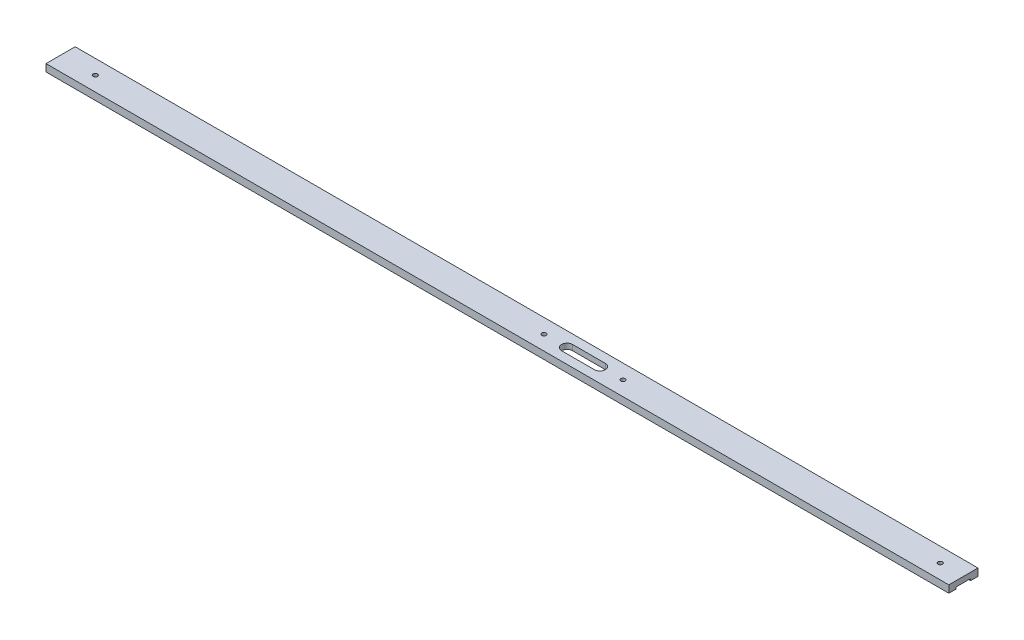
ISO-10303-21;
HEADER;
FILE_DESCRIPTION(('STEP AP214'),'2;1');
FILE_NAME('part.step','',(''),(''),'','','');
FILE_SCHEMA(('AUTOMOTIVE_DESIGN { 1 0 10303 214 1 1 1 1 }'));
ENDSEC;
DATA;
#1=APPLICATION_CONTEXT('core data for automotive mechanical design processes');
#2=APPLICATION_PROTOCOL_DEFINITION('international standard','automotive_design',2000,#1);
#3=PRODUCT_CONTEXT('',#1,'mechanical');
#4=PRODUCT('Part','Part','',(#3));
#5=PRODUCT_RELATED_PRODUCT_CATEGORY('part','',(#4));
#6=PRODUCT_DEFINITION_FORMATION('','',#4);
#7=PRODUCT_DEFINITION_CONTEXT('part definition',#1,'design');
#8=PRODUCT_DEFINITION('design','',#6,#7);
#9=PRODUCT_DEFINITION_SHAPE('','',#8);
#10=(LENGTH_UNIT() NAMED_UNIT(*) SI_UNIT(.MILLI.,.METRE.));
#11=(NAMED_UNIT(*) PLANE_ANGLE_UNIT() SI_UNIT($,.RADIAN.));
#12=(NAMED_UNIT(*) SI_UNIT($,.STERADIAN.) SOLID_ANGLE_UNIT());
#13=UNCERTAINTY_MEASURE_WITH_UNIT(LENGTH_MEASURE(1.E-05),#10,'distance_accuracy_value','');
#14=(GEOMETRIC_REPRESENTATION_CONTEXT(3) GLOBAL_UNCERTAINTY_ASSIGNED_CONTEXT((#13)) GLOBAL_UNIT_ASSIGNED_CONTEXT((#10,
#11,#12)) REPRESENTATION_CONTEXT('',''));
#15=CARTESIAN_POINT('',(0.,0.,0.));
#16=DIRECTION('',(0.,0.,1.));
#17=DIRECTION('',(1.,0.,0.));
#18=AXIS2_PLACEMENT_3D('',#15,#16,#17);
#19=CARTESIAN_POINT('',(123.825,2.,-4.));
#20=DIRECTION('',(0.,-1.,0.));
#21=DIRECTION('',(0.,0.,-1.));
#22=AXIS2_PLACEMENT_3D('',#19,#20,#21);
#23=PLANE('',#22);
#24=CARTESIAN_POINT('',(-114.3,2.,0.));
#25=DIRECTION('',(0.,1.,0.));
#26=DIRECTION('',(0.,0.,1.));
#27=AXIS2_PLACEMENT_3D('',#24,#25,#26);
#28=CIRCLE('',#27,0.595629999999986);
#29=CARTESIAN_POINT('',(-114.3,2.,0.595629999999986));
#30=VERTEX_POINT('',#29);
#31=EDGE_CURVE('E232',#30,#30,#28,.T.);
#32=ORIENTED_EDGE('',*,*,#31,.F.);
#33=EDGE_LOOP('',(#32));
#34=FACE_BOUND('',#33,.T.);
#35=CARTESIAN_POINT('',(8.7588,2.,0.));
#36=DIRECTION('',(0.,1.,0.));
#37=DIRECTION('',(0.,0.,1.));
#38=AXIS2_PLACEMENT_3D('',#35,#36,#37);
#39=CIRCLE('',#38,0.595629999999989);
#40=CARTESIAN_POINT('',(8.7588,2.,0.595629999999989));
#41=VERTEX_POINT('',#40);
#42=EDGE_CURVE('E222',#41,#41,#39,.T.);
#43=ORIENTED_EDGE('',*,*,#42,.F.);
#44=EDGE_LOOP('',(#43));
#45=FACE_BOUND('',#44,.T.);
#46=CARTESIAN_POINT('',(30.4588,2.,0.));
#47=DIRECTION('',(0.,1.,0.));
#48=DIRECTION('',(0.,0.,1.));
#49=AXIS2_PLACEMENT_3D('',#46,#47,#48);
#50=CIRCLE('',#49,0.595629999999989);
#51=CARTESIAN_POINT('',(30.4588,2.,0.595629999999989));
#52=VERTEX_POINT('',#51);
#53=EDGE_CURVE('E219',#52,#52,#50,.T.);
#54=ORIENTED_EDGE('',*,*,#53,.F.);
#55=EDGE_LOOP('',(#54));
#56=FACE_BOUND('',#55,.T.);
#57=CARTESIAN_POINT('',(117.475,2.,0.));
#58=DIRECTION('',(0.,1.,0.));
#59=DIRECTION('',(0.,0.,1.));
#60=AXIS2_PLACEMENT_3D('',#57,#58,#59);
#61=CIRCLE('',#60,0.595629999999986);
#62=CARTESIAN_POINT('',(117.475,2.,0.595629999999986));
#63=VERTEX_POINT('',#62);
#64=EDGE_CURVE('E216',#63,#63,#61,.T.);
#65=ORIENTED_EDGE('',*,*,#64,.F.);
#66=EDGE_LOOP('',(#65));
#67=FACE_BOUND('',#66,.T.);
#68=DIRECTION('',(0.,0.,-1.));
#69=VECTOR('',#68,1.);
#70=CARTESIAN_POINT('',(123.825,2.,4.));
#71=LINE('',#70,#69);
#72=CARTESIAN_POINT('',(123.825,2.,4.));
#73=VERTEX_POINT('',#72);
#74=CARTESIAN_POINT('',(123.825,2.,-4.));
#75=VERTEX_POINT('',#74);
#76=EDGE_CURVE('E181',#73,#75,#71,.T.);
#77=ORIENTED_EDGE('',*,*,#76,.T.);
#78=DIRECTION('',(-1.,0.,0.));
#79=VECTOR('',#78,1.);
#80=CARTESIAN_POINT('',(-123.825,2.,-4.));
#81=LINE('',#80,#79);
#82=CARTESIAN_POINT('',(-123.825,2.,-4.));
#83=VERTEX_POINT('',#82);
#84=EDGE_CURVE('E184',#75,#83,#81,.T.);
#85=ORIENTED_EDGE('',*,*,#84,.T.);
#86=DIRECTION('',(0.,0.,1.));
#87=VECTOR('',#86,1.);
#88=CARTESIAN_POINT('',(-123.825,2.,4.));
#89=LINE('',#88,#87);
#90=CARTESIAN_POINT('',(-123.825,2.,4.));
#91=VERTEX_POINT('',#90);
#92=EDGE_CURVE('E187',#83,#91,#89,.T.);
#93=ORIENTED_EDGE('',*,*,#92,.T.);
#94=DIRECTION('',(1.,0.,0.));
#95=VECTOR('',#94,1.);
#96=CARTESIAN_POINT('',(-123.825,2.,4.));
#97=LINE('',#96,#95);
#98=EDGE_CURVE('E189',#91,#73,#97,.T.);
#99=ORIENTED_EDGE('',*,*,#98,.T.);
#100=EDGE_LOOP('',(#77,#85,#93,#99));
#101=FACE_BOUND('',#100,.T.);
#102=CARTESIAN_POINT('',(15.1088,2.,0.));
#103=DIRECTION('',(0.,1.,0.));
#104=DIRECTION('',(0.,0.,1.));
#105=AXIS2_PLACEMENT_3D('',#102,#103,#104);
#106=CIRCLE('',#105,1.5);
#107=CARTESIAN_POINT('',(15.1088,2.,-1.5));
#108=VERTEX_POINT('',#107);
#109=CARTESIAN_POINT('',(15.1088,2.,1.5));
#110=VERTEX_POINT('',#109);
#111=EDGE_CURVE('E122',#108,#110,#106,.T.);
#112=ORIENTED_EDGE('',*,*,#111,.F.);
#113=DIRECTION('',(-1.,0.,0.));
#114=VECTOR('',#113,1.);
#115=CARTESIAN_POINT('',(15.1088,2.,-1.5));
#116=LINE('',#115,#114);
#117=CARTESIAN_POINT('',(24.1088,2.,-1.5));
#118=VERTEX_POINT('',#117);
#119=EDGE_CURVE('E144',#118,#108,#116,.T.);
#120=ORIENTED_EDGE('',*,*,#119,.F.);
#121=CARTESIAN_POINT('',(24.1088,2.,0.));
#122=DIRECTION('',(0.,1.,0.));
#123=DIRECTION('',(0.,0.,1.));
#124=AXIS2_PLACEMENT_3D('',#121,#122,#123);
#125=CIRCLE('',#124,1.5);
#126=CARTESIAN_POINT('',(24.1088,2.,1.5));
#127=VERTEX_POINT('',#126);
#128=EDGE_CURVE('E142',#127,#118,#125,.T.);
#129=ORIENTED_EDGE('',*,*,#128,.F.);
#130=DIRECTION('',(1.,0.,0.));
#131=VECTOR('',#130,1.);
#132=CARTESIAN_POINT('',(15.1088,2.,1.5));
#133=LINE('',#132,#131);
#134=EDGE_CURVE('E130',#110,#127,#133,.T.);
#135=ORIENTED_EDGE('',*,*,#134,.F.);
#136=EDGE_LOOP('',(#112,#120,#129,#135));
#137=FACE_BOUND('',#136,.T.);
#138=ADVANCED_FACE('F32',(#34,#45,#56,#67,#101,#137),#23,.F.);
#139=CARTESIAN_POINT('',(-123.825,0.5,2.));
#140=DIRECTION('',(0.,1.,0.));
#141=DIRECTION('',(0.,0.,1.));
#142=AXIS2_PLACEMENT_3D('',#139,#140,#141);
#143=PLANE('',#142);
#144=CARTESIAN_POINT('',(-114.3,0.5,0.));
#145=DIRECTION('',(0.,1.,0.));
#146=DIRECTION('',(0.,0.,1.));
#147=AXIS2_PLACEMENT_3D('',#144,#145,#146);
#148=CIRCLE('',#147,0.595629999999986);
#149=CARTESIAN_POINT('',(-114.3,0.5,0.595629999999986));
#150=VERTEX_POINT('',#149);
#151=EDGE_CURVE('E36',#150,#150,#148,.T.);
#152=ORIENTED_EDGE('',*,*,#151,.T.);
#153=EDGE_LOOP('',(#152));
#154=FACE_BOUND('',#153,.T.);
#155=CARTESIAN_POINT('',(8.7588,0.5,0.));
#156=DIRECTION('',(0.,1.,0.));
#157=DIRECTION('',(0.,0.,1.));
#158=AXIS2_PLACEMENT_3D('',#155,#156,#157);
#159=CIRCLE('',#158,0.595629999999988);
#160=CARTESIAN_POINT('',(8.7588,0.5,0.595629999999988));
#161=VERTEX_POINT('',#160);
#162=EDGE_CURVE('E220',#161,#161,#159,.T.);
#163=ORIENTED_EDGE('',*,*,#162,.T.);
#164=EDGE_LOOP('',(#163));
#165=FACE_BOUND('',#164,.T.);
#166=CARTESIAN_POINT('',(30.4588,0.5,0.));
#167=DIRECTION('',(0.,1.,0.));
#168=DIRECTION('',(0.,0.,1.));
#169=AXIS2_PLACEMENT_3D('',#166,#167,#168);
#170=CIRCLE('',#169,0.595629999999989);
#171=CARTESIAN_POINT('',(30.4588,0.5,0.595629999999989));
#172=VERTEX_POINT('',#171);
#173=EDGE_CURVE('E217',#172,#172,#170,.T.);
#174=ORIENTED_EDGE('',*,*,#173,.T.);
#175=EDGE_LOOP('',(#174));
#176=FACE_BOUND('',#175,.T.);
#177=CARTESIAN_POINT('',(117.475,0.5,0.));
#178=DIRECTION('',(0.,1.,0.));
#179=DIRECTION('',(0.,0.,1.));
#180=AXIS2_PLACEMENT_3D('',#177,#178,#179);
#181=CIRCLE('',#180,0.595629999999986);
#182=CARTESIAN_POINT('',(117.475,0.5,0.595629999999986));
#183=VERTEX_POINT('',#182);
#184=EDGE_CURVE('E150',#183,#183,#181,.T.);
#185=ORIENTED_EDGE('',*,*,#184,.T.);
#186=EDGE_LOOP('',(#185));
#187=FACE_BOUND('',#186,.T.);
#188=DIRECTION('',(0.,0.,1.));
#189=VECTOR('',#188,1.);
#190=CARTESIAN_POINT('',(123.825,0.5,2.));
#191=LINE('',#190,#189);
#192=CARTESIAN_POINT('',(123.825,0.5,-2.));
#193=VERTEX_POINT('',#192);
#194=CARTESIAN_POINT('',(123.825,0.5,2.));
#195=VERTEX_POINT('',#194);
#196=EDGE_CURVE('E172',#193,#195,#191,.T.);
#197=ORIENTED_EDGE('',*,*,#196,.T.);
#198=DIRECTION('',(1.,0.,0.));
#199=VECTOR('',#198,1.);
#200=CARTESIAN_POINT('',(-123.825,0.5,2.));
#201=LINE('',#200,#199);
#202=CARTESIAN_POINT('',(-123.825,0.5,2.));
#203=VERTEX_POINT('',#202);
#204=EDGE_CURVE('E176',#203,#195,#201,.T.);
#205=ORIENTED_EDGE('',*,*,#204,.F.);
#206=DIRECTION('',(0.,0.,1.));
#207=VECTOR('',#206,1.);
#208=CARTESIAN_POINT('',(-123.825,0.5,2.));
#209=LINE('',#208,#207);
#210=CARTESIAN_POINT('',(-123.825,0.5,-2.));
#211=VERTEX_POINT('',#210);
#212=EDGE_CURVE('E163',#211,#203,#209,.T.);
#213=ORIENTED_EDGE('',*,*,#212,.F.);
#214=DIRECTION('',(1.,0.,0.));
#215=VECTOR('',#214,1.);
#216=CARTESIAN_POINT('',(-123.825,0.5,-2.));
#217=LINE('',#216,#215);
#218=EDGE_CURVE('E170',#211,#193,#217,.T.);
#219=ORIENTED_EDGE('',*,*,#218,.T.);
#220=EDGE_LOOP('',(#197,#205,#213,#219));
#221=FACE_BOUND('',#220,.T.);
#222=CARTESIAN_POINT('',(15.1088,0.5,0.));
#223=DIRECTION('',(0.,1.,0.));
#224=DIRECTION('',(0.,0.,1.));
#225=AXIS2_PLACEMENT_3D('',#222,#223,#224);
#226=CIRCLE('',#225,1.5);
#227=CARTESIAN_POINT('',(15.1088,0.5,-1.5));
#228=VERTEX_POINT('',#227);
#229=CARTESIAN_POINT('',(15.1088,0.5,1.5));
#230=VERTEX_POINT('',#229);
#231=EDGE_CURVE('E57',#228,#230,#226,.T.);
#232=ORIENTED_EDGE('',*,*,#231,.T.);
#233=DIRECTION('',(1.,0.,0.));
#234=VECTOR('',#233,1.);
#235=CARTESIAN_POINT('',(15.1088,0.5,1.5));
#236=LINE('',#235,#234);
#237=CARTESIAN_POINT('',(24.1088,0.5,1.5));
#238=VERTEX_POINT('',#237);
#239=EDGE_CURVE('E137',#230,#238,#236,.T.);
#240=ORIENTED_EDGE('',*,*,#239,.T.);
#241=CARTESIAN_POINT('',(24.1088,0.5,0.));
#242=DIRECTION('',(0.,1.,0.));
#243=DIRECTION('',(0.,0.,1.));
#244=AXIS2_PLACEMENT_3D('',#241,#242,#243);
#245=CIRCLE('',#244,1.5);
#246=CARTESIAN_POINT('',(24.1088,0.5,-1.5));
#247=VERTEX_POINT('',#246);
#248=EDGE_CURVE('E152',#238,#247,#245,.T.);
#249=ORIENTED_EDGE('',*,*,#248,.T.);
#250=DIRECTION('',(-1.,0.,0.));
#251=VECTOR('',#250,1.);
#252=CARTESIAN_POINT('',(15.1088,0.5,-1.5));
#253=LINE('',#252,#251);
#254=EDGE_CURVE('E131',#247,#228,#253,.T.);
#255=ORIENTED_EDGE('',*,*,#254,.T.);
#256=EDGE_LOOP('',(#232,#240,#249,#255));
#257=FACE_BOUND('',#256,.T.);
#258=ADVANCED_FACE('F242',(#154,#165,#176,#187,#221,#257),#143,.F.);
#259=CARTESIAN_POINT('',(123.825,0.,-4.));
#260=DIRECTION('',(0.,-1.,0.));
#261=DIRECTION('',(0.,0.,-1.));
#262=AXIS2_PLACEMENT_3D('',#259,#260,#261);
#263=PLANE('',#262);
#264=DIRECTION('',(1.,0.,0.));
#265=VECTOR('',#264,1.);
#266=CARTESIAN_POINT('',(123.825,0.,-2.));
#267=LINE('',#266,#265);
#268=CARTESIAN_POINT('',(-123.825,0.,-2.));
#269=VERTEX_POINT('',#268);
#270=CARTESIAN_POINT('',(123.825,0.,-2.));
#271=VERTEX_POINT('',#270);
#272=EDGE_CURVE('E11',#269,#271,#267,.T.);
#273=ORIENTED_EDGE('',*,*,#272,.F.);
#274=DIRECTION('',(0.,0.,1.));
#275=VECTOR('',#274,1.);
#276=CARTESIAN_POINT('',(-123.825,0.,4.));
#277=LINE('',#276,#275);
#278=CARTESIAN_POINT('',(-123.825,0.,-4.));
#279=VERTEX_POINT('',#278);
#280=EDGE_CURVE('E198',#279,#269,#277,.T.);
#281=ORIENTED_EDGE('',*,*,#280,.F.);
#282=DIRECTION('',(-1.,0.,0.));
#283=VECTOR('',#282,1.);
#284=CARTESIAN_POINT('',(-123.825,0.,-4.));
#285=LINE('',#284,#283);
#286=CARTESIAN_POINT('',(123.825,0.,-4.));
#287=VERTEX_POINT('',#286);
#288=EDGE_CURVE('E195',#287,#279,#285,.T.);
#289=ORIENTED_EDGE('',*,*,#288,.F.);
#290=DIRECTION('',(0.,0.,-1.));
#291=VECTOR('',#290,1.);
#292=CARTESIAN_POINT('',(123.825,0.,4.));
#293=LINE('',#292,#291);
#294=EDGE_CURVE('E178',#271,#287,#293,.T.);
#295=ORIENTED_EDGE('',*,*,#294,.F.);
#296=EDGE_LOOP('',(#273,#281,#289,#295));
#297=FACE_BOUND('',#296,.T.);
#298=ADVANCED_FACE('F280',(#297),#263,.T.);
#299=CARTESIAN_POINT('',(123.825,2.,4.));
#300=DIRECTION('',(-1.,0.,0.));
#301=DIRECTION('',(0.,0.,1.));
#302=AXIS2_PLACEMENT_3D('',#299,#300,#301);
#303=PLANE('',#302);
#304=ORIENTED_EDGE('',*,*,#196,.F.);
#305=DIRECTION('',(0.,1.,0.));
#306=VECTOR('',#305,1.);
#307=CARTESIAN_POINT('',(123.825,-0.5,-2.));
#308=LINE('',#307,#306);
#309=EDGE_CURVE('E138',#271,#193,#308,.T.);
#310=ORIENTED_EDGE('',*,*,#309,.F.);
#311=ORIENTED_EDGE('',*,*,#294,.T.);
#312=DIRECTION('',(0.,-1.,0.));
#313=VECTOR('',#312,1.);
#314=CARTESIAN_POINT('',(123.825,2.,-4.));
#315=LINE('',#314,#313);
#316=EDGE_CURVE('E210',#75,#287,#315,.T.);
#317=ORIENTED_EDGE('',*,*,#316,.F.);
#318=ORIENTED_EDGE('',*,*,#76,.F.);
#319=DIRECTION('',(0.,-1.,0.));
#320=VECTOR('',#319,1.);
#321=CARTESIAN_POINT('',(123.825,2.,4.));
#322=LINE('',#321,#320);
#323=CARTESIAN_POINT('',(123.825,0.,4.));
#324=VERTEX_POINT('',#323);
#325=EDGE_CURVE('E191',#73,#324,#322,.T.);
#326=ORIENTED_EDGE('',*,*,#325,.T.);
#327=CARTESIAN_POINT('',(123.825,0.,2.));
#328=VERTEX_POINT('',#327);
#329=EDGE_CURVE('E192',#324,#328,#293,.T.);
#330=ORIENTED_EDGE('',*,*,#329,.T.);
#331=DIRECTION('',(0.,-1.,0.));
#332=VECTOR('',#331,1.);
#333=CARTESIAN_POINT('',(123.825,-0.5,2.));
#334=LINE('',#333,#332);
#335=EDGE_CURVE('E164',#195,#328,#334,.T.);
#336=ORIENTED_EDGE('',*,*,#335,.F.);
#337=EDGE_LOOP('',(#304,#310,#311,#317,#318,#326,#330,#336));
#338=FACE_BOUND('',#337,.T.);
#339=ADVANCED_FACE('F34',(#338),#303,.F.);
#340=CARTESIAN_POINT('',(-123.825,2.,-4.));
#341=DIRECTION('',(0.,0.,1.));
#342=DIRECTION('',(1.,0.,0.));
#343=AXIS2_PLACEMENT_3D('',#340,#341,#342);
#344=PLANE('',#343);
#345=ORIENTED_EDGE('',*,*,#288,.T.);
#346=DIRECTION('',(0.,-1.,0.));
#347=VECTOR('',#346,1.);
#348=CARTESIAN_POINT('',(-123.825,2.,-4.));
#349=LINE('',#348,#347);
#350=EDGE_CURVE('E207',#83,#279,#349,.T.);
#351=ORIENTED_EDGE('',*,*,#350,.F.);
#352=ORIENTED_EDGE('',*,*,#84,.F.);
#353=ORIENTED_EDGE('',*,*,#316,.T.);
#354=EDGE_LOOP('',(#345,#351,#352,#353));
#355=FACE_BOUND('',#354,.T.);
#356=ADVANCED_FACE('F256',(#355),#344,.F.);
#357=CARTESIAN_POINT('',(-123.825,2.,4.));
#358=DIRECTION('',(1.,0.,0.));
#359=DIRECTION('',(0.,0.,-1.));
#360=AXIS2_PLACEMENT_3D('',#357,#358,#359);
#361=PLANE('',#360);
#362=ORIENTED_EDGE('',*,*,#280,.T.);
#363=DIRECTION('',(0.,1.,0.));
#364=VECTOR('',#363,1.);
#365=CARTESIAN_POINT('',(-123.825,-0.5,-2.));
#366=LINE('',#365,#364);
#367=EDGE_CURVE('E160',#269,#211,#366,.T.);
#368=ORIENTED_EDGE('',*,*,#367,.T.);
#369=ORIENTED_EDGE('',*,*,#212,.T.);
#370=DIRECTION('',(0.,-1.,0.));
#371=VECTOR('',#370,1.);
#372=CARTESIAN_POINT('',(-123.825,-0.5,2.));
#373=LINE('',#372,#371);
#374=CARTESIAN_POINT('',(-123.825,0.,2.));
#375=VERTEX_POINT('',#374);
#376=EDGE_CURVE('E167',#203,#375,#373,.T.);
#377=ORIENTED_EDGE('',*,*,#376,.T.);
#378=CARTESIAN_POINT('',(-123.825,0.,4.));
#379=VERTEX_POINT('',#378);
#380=EDGE_CURVE('E197',#375,#379,#277,.T.);
#381=ORIENTED_EDGE('',*,*,#380,.T.);
#382=DIRECTION('',(0.,-1.,0.));
#383=VECTOR('',#382,1.);
#384=CARTESIAN_POINT('',(-123.825,2.,4.));
#385=LINE('',#384,#383);
#386=EDGE_CURVE('E204',#91,#379,#385,.T.);
#387=ORIENTED_EDGE('',*,*,#386,.F.);
#388=ORIENTED_EDGE('',*,*,#92,.F.);
#389=ORIENTED_EDGE('',*,*,#350,.T.);
#390=EDGE_LOOP('',(#362,#368,#369,#377,#381,#387,#388,#389));
#391=FACE_BOUND('',#390,.T.);
#392=ADVANCED_FACE('F261',(#391),#361,.F.);
#393=CARTESIAN_POINT('',(-123.825,2.,4.));
#394=DIRECTION('',(0.,0.,-1.));
#395=DIRECTION('',(-1.,0.,0.));
#396=AXIS2_PLACEMENT_3D('',#393,#394,#395);
#397=PLANE('',#396);
#398=DIRECTION('',(1.,0.,0.));
#399=VECTOR('',#398,1.);
#400=CARTESIAN_POINT('',(-123.825,0.,4.));
#401=LINE('',#400,#399);
#402=EDGE_CURVE('E185',#379,#324,#401,.T.);
#403=ORIENTED_EDGE('',*,*,#402,.T.);
#404=ORIENTED_EDGE('',*,*,#325,.F.);
#405=ORIENTED_EDGE('',*,*,#98,.F.);
#406=ORIENTED_EDGE('',*,*,#386,.T.);
#407=EDGE_LOOP('',(#403,#404,#405,#406));
#408=FACE_BOUND('',#407,.T.);
#409=ADVANCED_FACE('F265',(#408),#397,.F.);
#410=DIRECTION('',(-1.,0.,0.));
#411=VECTOR('',#410,1.);
#412=CARTESIAN_POINT('',(123.825,0.,2.));
#413=LINE('',#412,#411);
#414=EDGE_CURVE('E41',#328,#375,#413,.T.);
#415=ORIENTED_EDGE('',*,*,#414,.F.);
#416=ORIENTED_EDGE('',*,*,#329,.F.);
#417=ORIENTED_EDGE('',*,*,#402,.F.);
#418=ORIENTED_EDGE('',*,*,#380,.F.);
#419=EDGE_LOOP('',(#415,#416,#417,#418));
#420=FACE_BOUND('',#419,.T.);
#421=ADVANCED_FACE('F270',(#420),#263,.T.);
#422=CARTESIAN_POINT('',(-123.825,-0.5,-2.));
#423=DIRECTION('',(0.,0.,-1.));
#424=DIRECTION('',(-1.,0.,0.));
#425=AXIS2_PLACEMENT_3D('',#422,#423,#424);
#426=PLANE('',#425);
#427=ORIENTED_EDGE('',*,*,#272,.T.);
#428=ORIENTED_EDGE('',*,*,#309,.T.);
#429=ORIENTED_EDGE('',*,*,#218,.F.);
#430=ORIENTED_EDGE('',*,*,#367,.F.);
#431=EDGE_LOOP('',(#427,#428,#429,#430));
#432=FACE_BOUND('',#431,.T.);
#433=ADVANCED_FACE('F281',(#432),#426,.F.);
#434=CARTESIAN_POINT('',(-123.825,-0.5,2.));
#435=DIRECTION('',(0.,0.,1.));
#436=DIRECTION('',(1.,0.,0.));
#437=AXIS2_PLACEMENT_3D('',#434,#435,#436);
#438=PLANE('',#437);
#439=ORIENTED_EDGE('',*,*,#414,.T.);
#440=ORIENTED_EDGE('',*,*,#376,.F.);
#441=ORIENTED_EDGE('',*,*,#204,.T.);
#442=ORIENTED_EDGE('',*,*,#335,.T.);
#443=EDGE_LOOP('',(#439,#440,#441,#442));
#444=FACE_BOUND('',#443,.T.);
#445=ADVANCED_FACE('F273',(#444),#438,.F.);
#446=CARTESIAN_POINT('',(15.1088,2.,0.));
#447=DIRECTION('',(0.,-1.,0.));
#448=DIRECTION('',(0.,0.,-1.));
#449=AXIS2_PLACEMENT_3D('',#446,#447,#448);
#450=CYLINDRICAL_SURFACE('',#449,1.5);
#451=ORIENTED_EDGE('',*,*,#231,.F.);
#452=DIRECTION('',(0.,-1.,0.));
#453=VECTOR('',#452,1.);
#454=CARTESIAN_POINT('',(15.1088,2.,-1.5));
#455=LINE('',#454,#453);
#456=EDGE_CURVE('E126',#108,#228,#455,.T.);
#457=ORIENTED_EDGE('',*,*,#456,.F.);
#458=ORIENTED_EDGE('',*,*,#111,.T.);
#459=DIRECTION('',(0.,-1.,0.));
#460=VECTOR('',#459,1.);
#461=CARTESIAN_POINT('',(15.1088,2.,1.5));
#462=LINE('',#461,#460);
#463=EDGE_CURVE('E125',#110,#230,#462,.T.);
#464=ORIENTED_EDGE('',*,*,#463,.T.);
#465=EDGE_LOOP('',(#451,#457,#458,#464));
#466=FACE_BOUND('',#465,.T.);
#467=ADVANCED_FACE('F124',(#466),#450,.F.);
#468=CARTESIAN_POINT('',(15.1088,2.,1.5));
#469=DIRECTION('',(0.,0.,-1.));
#470=DIRECTION('',(-1.,0.,0.));
#471=AXIS2_PLACEMENT_3D('',#468,#469,#470);
#472=PLANE('',#471);
#473=ORIENTED_EDGE('',*,*,#239,.F.);
#474=ORIENTED_EDGE('',*,*,#463,.F.);
#475=ORIENTED_EDGE('',*,*,#134,.T.);
#476=DIRECTION('',(0.,-1.,0.));
#477=VECTOR('',#476,1.);
#478=CARTESIAN_POINT('',(24.1088,2.,1.5));
#479=LINE('',#478,#477);
#480=EDGE_CURVE('E139',#127,#238,#479,.T.);
#481=ORIENTED_EDGE('',*,*,#480,.T.);
#482=EDGE_LOOP('',(#473,#474,#475,#481));
#483=FACE_BOUND('',#482,.T.);
#484=ADVANCED_FACE('F134',(#483),#472,.T.);
#485=CARTESIAN_POINT('',(24.1088,2.,0.));
#486=DIRECTION('',(0.,-1.,0.));
#487=DIRECTION('',(0.,0.,-1.));
#488=AXIS2_PLACEMENT_3D('',#485,#486,#487);
#489=CYLINDRICAL_SURFACE('',#488,1.5);
#490=ORIENTED_EDGE('',*,*,#248,.F.);
#491=ORIENTED_EDGE('',*,*,#480,.F.);
#492=ORIENTED_EDGE('',*,*,#128,.T.);
#493=DIRECTION('',(0.,-1.,0.));
#494=VECTOR('',#493,1.);
#495=CARTESIAN_POINT('',(24.1088,2.,-1.5));
#496=LINE('',#495,#494);
#497=EDGE_CURVE('E49',#118,#247,#496,.T.);
#498=ORIENTED_EDGE('',*,*,#497,.T.);
#499=EDGE_LOOP('',(#490,#491,#492,#498));
#500=FACE_BOUND('',#499,.T.);
#501=ADVANCED_FACE('F324',(#500),#489,.F.);
#502=CARTESIAN_POINT('',(15.1088,2.,-1.5));
#503=DIRECTION('',(0.,0.,1.));
#504=DIRECTION('',(1.,0.,0.));
#505=AXIS2_PLACEMENT_3D('',#502,#503,#504);
#506=PLANE('',#505);
#507=ORIENTED_EDGE('',*,*,#254,.F.);
#508=ORIENTED_EDGE('',*,*,#497,.F.);
#509=ORIENTED_EDGE('',*,*,#119,.T.);
#510=ORIENTED_EDGE('',*,*,#456,.T.);
#511=EDGE_LOOP('',(#507,#508,#509,#510));
#512=FACE_BOUND('',#511,.T.);
#513=ADVANCED_FACE('F315',(#512),#506,.T.);
#514=CARTESIAN_POINT('',(117.475,2.,0.));
#515=DIRECTION('',(0.,1.,0.));
#516=DIRECTION('',(0.,0.,1.));
#517=AXIS2_PLACEMENT_3D('',#514,#515,#516);
#518=CYLINDRICAL_SURFACE('',#517,0.595629999999986);
#519=ORIENTED_EDGE('',*,*,#64,.T.);
#520=EDGE_LOOP('',(#519));
#521=FACE_BOUND('',#520,.T.);
#522=ORIENTED_EDGE('',*,*,#184,.F.);
#523=EDGE_LOOP('',(#522));
#524=FACE_BOUND('',#523,.T.);
#525=ADVANCED_FACE('F237',(#521,#524),#518,.F.);
#526=CARTESIAN_POINT('',(30.4588,2.,0.));
#527=DIRECTION('',(0.,1.,0.));
#528=DIRECTION('',(0.,0.,1.));
#529=AXIS2_PLACEMENT_3D('',#526,#527,#528);
#530=CYLINDRICAL_SURFACE('',#529,0.595629999999989);
#531=ORIENTED_EDGE('',*,*,#53,.T.);
#532=EDGE_LOOP('',(#531));
#533=FACE_BOUND('',#532,.T.);
#534=ORIENTED_EDGE('',*,*,#173,.F.);
#535=EDGE_LOOP('',(#534));
#536=FACE_BOUND('',#535,.T.);
#537=ADVANCED_FACE('F314',(#533,#536),#530,.F.);
#538=CARTESIAN_POINT('',(8.7588,2.,0.));
#539=DIRECTION('',(0.,1.,0.));
#540=DIRECTION('',(0.,0.,1.));
#541=AXIS2_PLACEMENT_3D('',#538,#539,#540);
#542=CYLINDRICAL_SURFACE('',#541,0.595629999999988);
#543=ORIENTED_EDGE('',*,*,#42,.T.);
#544=EDGE_LOOP('',(#543));
#545=FACE_BOUND('',#544,.T.);
#546=ORIENTED_EDGE('',*,*,#162,.F.);
#547=EDGE_LOOP('',(#546));
#548=FACE_BOUND('',#547,.T.);
#549=ADVANCED_FACE('F321',(#545,#548),#542,.F.);
#550=CARTESIAN_POINT('',(-114.3,2.,0.));
#551=DIRECTION('',(0.,1.,0.));
#552=DIRECTION('',(0.,0.,1.));
#553=AXIS2_PLACEMENT_3D('',#550,#551,#552);
#554=CYLINDRICAL_SURFACE('',#553,0.595629999999986);
#555=ORIENTED_EDGE('',*,*,#31,.T.);
#556=EDGE_LOOP('',(#555));
#557=FACE_BOUND('',#556,.T.);
#558=ORIENTED_EDGE('',*,*,#151,.F.);
#559=EDGE_LOOP('',(#558));
#560=FACE_BOUND('',#559,.T.);
#561=ADVANCED_FACE('F380',(#557,#560),#554,.F.);
#562=CLOSED_SHELL('',(#138,#258,#298,#339,#356,#392,#409,#421,#433,#445,#467,#484,#501,#513,
#525,#537,#549,#561));
#563=MANIFOLD_SOLID_BREP('B2',#562);
#564=ADVANCED_BREP_SHAPE_REPRESENTATION('',(#18,#563),#14);
#565=SHAPE_DEFINITION_REPRESENTATION(#9,#564);
ENDSEC;
END-ISO-10303-21;
